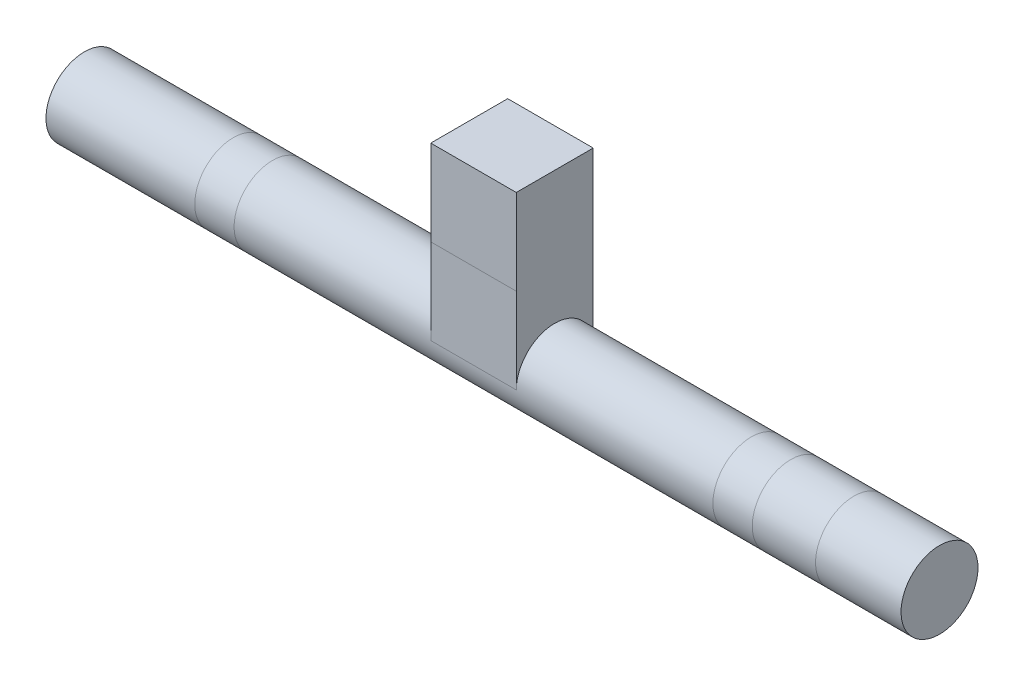
ISO-10303-21;
HEADER;
FILE_DESCRIPTION(('STEP AP214'),'2;1');
FILE_NAME('part.step','',(''),(''),'','','');
FILE_SCHEMA(('AUTOMOTIVE_DESIGN { 1 0 10303 214 1 1 1 1 }'));
ENDSEC;
DATA;
#1=APPLICATION_CONTEXT('core data for automotive mechanical design processes');
#2=APPLICATION_PROTOCOL_DEFINITION('international standard','automotive_design',2000,#1);
#3=PRODUCT_CONTEXT('',#1,'mechanical');
#4=PRODUCT('Part','Part','',(#3));
#5=PRODUCT_RELATED_PRODUCT_CATEGORY('part','',(#4));
#6=PRODUCT_DEFINITION_FORMATION('','',#4);
#7=PRODUCT_DEFINITION_CONTEXT('part definition',#1,'design');
#8=PRODUCT_DEFINITION('design','',#6,#7);
#9=PRODUCT_DEFINITION_SHAPE('','',#8);
#10=(LENGTH_UNIT() NAMED_UNIT(*) SI_UNIT(.MILLI.,.METRE.));
#11=(NAMED_UNIT(*) PLANE_ANGLE_UNIT() SI_UNIT($,.RADIAN.));
#12=(NAMED_UNIT(*) SI_UNIT($,.STERADIAN.) SOLID_ANGLE_UNIT());
#13=UNCERTAINTY_MEASURE_WITH_UNIT(LENGTH_MEASURE(1.E-05),#10,'distance_accuracy_value','');
#14=(GEOMETRIC_REPRESENTATION_CONTEXT(3) GLOBAL_UNCERTAINTY_ASSIGNED_CONTEXT((#13)) GLOBAL_UNIT_ASSIGNED_CONTEXT((#10,
#11,#12)) REPRESENTATION_CONTEXT('',''));
#15=CARTESIAN_POINT('',(0.,0.,0.));
#16=DIRECTION('',(0.,0.,1.));
#17=DIRECTION('',(1.,0.,0.));
#18=AXIS2_PLACEMENT_3D('',#15,#16,#17);
#19=CARTESIAN_POINT('',(50.,200.,45.));
#20=DIRECTION('',(0.,0.,-1.));
#21=DIRECTION('',(0.,1.,0.));
#22=AXIS2_PLACEMENT_3D('',#19,#20,#21);
#23=PLANE('',#22);
#24=DIRECTION('',(1.,0.,0.));
#25=VECTOR('',#24,1.);
#26=CARTESIAN_POINT('',(50.0000000000001,100.,45.));
#27=LINE('',#26,#25);
#28=CARTESIAN_POINT('',(-50.,100.,45.));
#29=VERTEX_POINT('',#28);
#30=CARTESIAN_POINT('',(50.,100.,45.));
#31=VERTEX_POINT('',#30);
#32=EDGE_CURVE('E12',#29,#31,#27,.T.);
#33=ORIENTED_EDGE('',*,*,#32,.F.);
#34=DIRECTION('',(0.,-1.,0.));
#35=VECTOR('',#34,1.);
#36=CARTESIAN_POINT('',(-50.,200.,45.));
#37=LINE('',#36,#35);
#38=CARTESIAN_POINT('',(-50.,0.,45.));
#39=VERTEX_POINT('',#38);
#40=EDGE_CURVE('E154',#29,#39,#37,.T.);
#41=ORIENTED_EDGE('',*,*,#40,.T.);
#42=DIRECTION('',(-1.,0.,0.));
#43=VECTOR('',#42,1.);
#44=CARTESIAN_POINT('',(50.,0.,45.));
#45=LINE('',#44,#43);
#46=CARTESIAN_POINT('',(50.,0.,45.));
#47=VERTEX_POINT('',#46);
#48=EDGE_CURVE('E164',#47,#39,#45,.T.);
#49=ORIENTED_EDGE('',*,*,#48,.F.);
#50=DIRECTION('',(0.,-1.,0.));
#51=VECTOR('',#50,1.);
#52=CARTESIAN_POINT('',(50.,200.,45.));
#53=LINE('',#52,#51);
#54=EDGE_CURVE('E246',#31,#47,#53,.T.);
#55=ORIENTED_EDGE('',*,*,#54,.F.);
#56=EDGE_LOOP('',(#33,#41,#49,#55));
#57=FACE_BOUND('',#56,.T.);
#58=ADVANCED_FACE('F47',(#57),#23,.F.);
#59=CARTESIAN_POINT('',(500.,0.,0.));
#60=DIRECTION('',(-1.,0.,0.));
#61=DIRECTION('',(0.,0.,1.));
#62=AXIS2_PLACEMENT_3D('',#59,#60,#61);
#63=CYLINDRICAL_SURFACE('',#62,45.);
#64=CARTESIAN_POINT('',(280.,0.,0.));
#65=DIRECTION('',(1.,0.,0.));
#66=DIRECTION('',(0.,0.,-1.));
#67=AXIS2_PLACEMENT_3D('',#64,#65,#66);
#68=CIRCLE('',#67,45.);
#69=CARTESIAN_POINT('',(280.,-45.,0.));
#70=VERTEX_POINT('',#69);
#71=CARTESIAN_POINT('',(280.,45.,0.));
#72=VERTEX_POINT('',#71);
#73=EDGE_CURVE('E194',#70,#72,#68,.T.);
#74=ORIENTED_EDGE('',*,*,#73,.T.);
#75=EDGE_CURVE('E198',#72,#70,#68,.T.);
#76=ORIENTED_EDGE('',*,*,#75,.T.);
#77=EDGE_LOOP('',(#74,#76));
#78=FACE_BOUND('',#77,.T.);
#79=CARTESIAN_POINT('',(326.,0.,0.));
#80=DIRECTION('',(1.,0.,0.));
#81=DIRECTION('',(0.,1.,0.));
#82=AXIS2_PLACEMENT_3D('',#79,#80,#81);
#83=CIRCLE('',#82,45.);
#84=CARTESIAN_POINT('',(326.,45.,0.));
#85=VERTEX_POINT('',#84);
#86=CARTESIAN_POINT('',(326.,-45.,0.));
#87=VERTEX_POINT('',#86);
#88=EDGE_CURVE('E56',#85,#87,#83,.T.);
#89=ORIENTED_EDGE('',*,*,#88,.F.);
#90=EDGE_CURVE('E199',#87,#85,#83,.T.);
#91=ORIENTED_EDGE('',*,*,#90,.F.);
#92=EDGE_LOOP('',(#89,#91));
#93=FACE_BOUND('',#92,.T.);
#94=ADVANCED_FACE('F212',(#78,#93),#63,.T.);
#95=DIRECTION('',(-1.,0.,0.));
#96=VECTOR('',#95,1.);
#97=CARTESIAN_POINT('',(50.,0.,-45.));
#98=LINE('',#97,#96);
#99=CARTESIAN_POINT('',(50.,0.,-45.));
#100=VERTEX_POINT('',#99);
#101=CARTESIAN_POINT('',(-50.,0.,-45.));
#102=VERTEX_POINT('',#101);
#103=EDGE_CURVE('E142',#100,#102,#98,.T.);
#104=ORIENTED_EDGE('',*,*,#103,.F.);
#105=CARTESIAN_POINT('',(50.,0.,0.));
#106=DIRECTION('',(1.,0.,0.));
#107=DIRECTION('',(0.,0.,-1.));
#108=AXIS2_PLACEMENT_3D('',#105,#106,#107);
#109=CIRCLE('',#108,45.);
#110=EDGE_CURVE('E130',#100,#47,#109,.T.);
#111=ORIENTED_EDGE('',*,*,#110,.T.);
#112=ORIENTED_EDGE('',*,*,#48,.T.);
#113=CARTESIAN_POINT('',(-50.,0.,0.));
#114=DIRECTION('',(1.,0.,0.));
#115=DIRECTION('',(0.,0.,-1.));
#116=AXIS2_PLACEMENT_3D('',#113,#114,#115);
#117=CIRCLE('',#116,45.);
#118=EDGE_CURVE('E172',#102,#39,#117,.T.);
#119=ORIENTED_EDGE('',*,*,#118,.F.);
#120=EDGE_LOOP('',(#104,#111,#112,#119));
#121=FACE_BOUND('',#120,.T.);
#122=CARTESIAN_POINT('',(-280.,0.,0.));
#123=DIRECTION('',(1.,0.,0.));
#124=DIRECTION('',(0.,0.,-1.));
#125=AXIS2_PLACEMENT_3D('',#122,#123,#124);
#126=CIRCLE('',#125,45.);
#127=CARTESIAN_POINT('',(-280.,-45.,0.));
#128=VERTEX_POINT('',#127);
#129=CARTESIAN_POINT('',(-280.,45.,0.));
#130=VERTEX_POINT('',#129);
#131=EDGE_CURVE('E189',#128,#130,#126,.T.);
#132=ORIENTED_EDGE('',*,*,#131,.T.);
#133=EDGE_CURVE('E193',#130,#128,#126,.T.);
#134=ORIENTED_EDGE('',*,*,#133,.T.);
#135=EDGE_LOOP('',(#132,#134));
#136=FACE_BOUND('',#135,.T.);
#137=ORIENTED_EDGE('',*,*,#75,.F.);
#138=ORIENTED_EDGE('',*,*,#73,.F.);
#139=EDGE_LOOP('',(#137,#138));
#140=FACE_BOUND('',#139,.T.);
#141=ADVANCED_FACE('F215',(#121,#136,#140),#63,.T.);
#142=CARTESIAN_POINT('',(-326.,0.,0.));
#143=DIRECTION('',(1.,0.,0.));
#144=DIRECTION('',(0.,0.,-1.));
#145=AXIS2_PLACEMENT_3D('',#142,#143,#144);
#146=CIRCLE('',#145,45.);
#147=CARTESIAN_POINT('',(-326.,-45.,0.));
#148=VERTEX_POINT('',#147);
#149=CARTESIAN_POINT('',(-326.,45.,0.));
#150=VERTEX_POINT('',#149);
#151=EDGE_CURVE('E178',#148,#150,#146,.T.);
#152=ORIENTED_EDGE('',*,*,#151,.T.);
#153=EDGE_CURVE('E183',#150,#148,#146,.T.);
#154=ORIENTED_EDGE('',*,*,#153,.T.);
#155=EDGE_LOOP('',(#152,#154));
#156=FACE_BOUND('',#155,.T.);
#157=ORIENTED_EDGE('',*,*,#133,.F.);
#158=ORIENTED_EDGE('',*,*,#131,.F.);
#159=EDGE_LOOP('',(#157,#158));
#160=FACE_BOUND('',#159,.T.);
#161=ADVANCED_FACE('F217',(#156,#160),#63,.T.);
#162=ORIENTED_EDGE('',*,*,#90,.T.);
#163=ORIENTED_EDGE('',*,*,#88,.T.);
#164=EDGE_LOOP('',(#162,#163));
#165=FACE_BOUND('',#164,.T.);
#166=CARTESIAN_POINT('',(400.,0.,0.));
#167=DIRECTION('',(1.,0.,0.));
#168=DIRECTION('',(0.,0.,-1.));
#169=AXIS2_PLACEMENT_3D('',#166,#167,#168);
#170=CIRCLE('',#169,45.);
#171=CARTESIAN_POINT('',(400.,45.,0.));
#172=VERTEX_POINT('',#171);
#173=CARTESIAN_POINT('',(400.,-45.,0.));
#174=VERTEX_POINT('',#173);
#175=EDGE_CURVE('E188',#172,#174,#170,.T.);
#176=ORIENTED_EDGE('',*,*,#175,.F.);
#177=EDGE_CURVE('E184',#174,#172,#170,.T.);
#178=ORIENTED_EDGE('',*,*,#177,.F.);
#179=EDGE_LOOP('',(#176,#178));
#180=FACE_BOUND('',#179,.T.);
#181=ADVANCED_FACE('F223',(#165,#180),#63,.T.);
#182=CARTESIAN_POINT('',(-500.,0.,0.));
#183=DIRECTION('',(1.,0.,0.));
#184=DIRECTION('',(0.,0.,-1.));
#185=AXIS2_PLACEMENT_3D('',#182,#183,#184);
#186=CIRCLE('',#185,45.);
#187=CARTESIAN_POINT('',(-500.,0.,-45.));
#188=VERTEX_POINT('',#187);
#189=EDGE_CURVE('E167',#188,#188,#186,.T.);
#190=ORIENTED_EDGE('',*,*,#189,.T.);
#191=EDGE_LOOP('',(#190));
#192=FACE_BOUND('',#191,.T.);
#193=ORIENTED_EDGE('',*,*,#153,.F.);
#194=ORIENTED_EDGE('',*,*,#151,.F.);
#195=EDGE_LOOP('',(#193,#194));
#196=FACE_BOUND('',#195,.T.);
#197=ADVANCED_FACE('F304',(#192,#196),#63,.T.);
#198=ORIENTED_EDGE('',*,*,#177,.T.);
#199=ORIENTED_EDGE('',*,*,#175,.T.);
#200=EDGE_LOOP('',(#198,#199));
#201=FACE_BOUND('',#200,.T.);
#202=CARTESIAN_POINT('',(500.,0.,0.));
#203=DIRECTION('',(1.,0.,0.));
#204=DIRECTION('',(0.,0.,-1.));
#205=AXIS2_PLACEMENT_3D('',#202,#203,#204);
#206=CIRCLE('',#205,45.);
#207=CARTESIAN_POINT('',(500.,0.,-45.));
#208=VERTEX_POINT('',#207);
#209=EDGE_CURVE('E168',#208,#208,#206,.T.);
#210=ORIENTED_EDGE('',*,*,#209,.F.);
#211=EDGE_LOOP('',(#210));
#212=FACE_BOUND('',#211,.T.);
#213=ADVANCED_FACE('F49',(#201,#212),#63,.T.);
#214=CARTESIAN_POINT('',(500.,0.,0.));
#215=DIRECTION('',(1.,0.,0.));
#216=DIRECTION('',(0.,0.,-1.));
#217=AXIS2_PLACEMENT_3D('',#214,#215,#216);
#218=PLANE('',#217);
#219=ORIENTED_EDGE('',*,*,#209,.T.);
#220=EDGE_LOOP('',(#219));
#221=FACE_BOUND('',#220,.T.);
#222=ADVANCED_FACE('F239',(#221),#218,.T.);
#223=CARTESIAN_POINT('',(-500.,0.,0.));
#224=DIRECTION('',(1.,0.,0.));
#225=DIRECTION('',(0.,0.,-1.));
#226=AXIS2_PLACEMENT_3D('',#223,#224,#225);
#227=PLANE('',#226);
#228=ORIENTED_EDGE('',*,*,#189,.F.);
#229=EDGE_LOOP('',(#228));
#230=FACE_BOUND('',#229,.T.);
#231=ADVANCED_FACE('F234',(#230),#227,.F.);
#232=CARTESIAN_POINT('',(-50.,200.,45.));
#233=VERTEX_POINT('',#232);
#234=EDGE_CURVE('E151',#233,#29,#37,.T.);
#235=ORIENTED_EDGE('',*,*,#234,.T.);
#236=ORIENTED_EDGE('',*,*,#32,.T.);
#237=CARTESIAN_POINT('',(50.,200.,45.));
#238=VERTEX_POINT('',#237);
#239=EDGE_CURVE('E133',#238,#31,#53,.T.);
#240=ORIENTED_EDGE('',*,*,#239,.F.);
#241=DIRECTION('',(-1.,0.,0.));
#242=VECTOR('',#241,1.);
#243=CARTESIAN_POINT('',(50.,200.,45.));
#244=LINE('',#243,#242);
#245=EDGE_CURVE('E143',#238,#233,#244,.T.);
#246=ORIENTED_EDGE('',*,*,#245,.T.);
#247=EDGE_LOOP('',(#235,#236,#240,#246));
#248=FACE_BOUND('',#247,.T.);
#249=ADVANCED_FACE('F228',(#248),#23,.F.);
#250=CARTESIAN_POINT('',(50.,200.,-45.));
#251=DIRECTION('',(0.,0.,1.));
#252=DIRECTION('',(0.,-1.,0.));
#253=AXIS2_PLACEMENT_3D('',#250,#251,#252);
#254=PLANE('',#253);
#255=DIRECTION('',(0.,1.,0.));
#256=VECTOR('',#255,1.);
#257=CARTESIAN_POINT('',(-50.,200.,-45.));
#258=LINE('',#257,#256);
#259=CARTESIAN_POINT('',(-50.,200.,-45.));
#260=VERTEX_POINT('',#259);
#261=EDGE_CURVE('E139',#102,#260,#258,.T.);
#262=ORIENTED_EDGE('',*,*,#261,.T.);
#263=DIRECTION('',(-1.,0.,0.));
#264=VECTOR('',#263,1.);
#265=CARTESIAN_POINT('',(50.,200.,-45.));
#266=LINE('',#265,#264);
#267=CARTESIAN_POINT('',(50.,200.,-45.));
#268=VERTEX_POINT('',#267);
#269=EDGE_CURVE('E136',#268,#260,#266,.T.);
#270=ORIENTED_EDGE('',*,*,#269,.F.);
#271=DIRECTION('',(0.,1.,0.));
#272=VECTOR('',#271,1.);
#273=CARTESIAN_POINT('',(50.,200.,-45.));
#274=LINE('',#273,#272);
#275=EDGE_CURVE('E122',#100,#268,#274,.T.);
#276=ORIENTED_EDGE('',*,*,#275,.F.);
#277=ORIENTED_EDGE('',*,*,#103,.T.);
#278=EDGE_LOOP('',(#262,#270,#276,#277));
#279=FACE_BOUND('',#278,.T.);
#280=ADVANCED_FACE('F137',(#279),#254,.F.);
#281=CARTESIAN_POINT('',(50.,200.,45.));
#282=DIRECTION('',(0.,-1.,0.));
#283=DIRECTION('',(0.,0.,-1.));
#284=AXIS2_PLACEMENT_3D('',#281,#282,#283);
#285=PLANE('',#284);
#286=DIRECTION('',(0.,0.,1.));
#287=VECTOR('',#286,1.);
#288=CARTESIAN_POINT('',(-50.,200.,45.));
#289=LINE('',#288,#287);
#290=EDGE_CURVE('E161',#260,#233,#289,.T.);
#291=ORIENTED_EDGE('',*,*,#290,.T.);
#292=ORIENTED_EDGE('',*,*,#245,.F.);
#293=DIRECTION('',(0.,0.,1.));
#294=VECTOR('',#293,1.);
#295=CARTESIAN_POINT('',(50.,200.,45.));
#296=LINE('',#295,#294);
#297=EDGE_CURVE('E127',#268,#238,#296,.T.);
#298=ORIENTED_EDGE('',*,*,#297,.F.);
#299=ORIENTED_EDGE('',*,*,#269,.T.);
#300=EDGE_LOOP('',(#291,#292,#298,#299));
#301=FACE_BOUND('',#300,.T.);
#302=ADVANCED_FACE('F145',(#301),#285,.F.);
#303=CARTESIAN_POINT('',(50.,0.,0.));
#304=DIRECTION('',(1.,0.,0.));
#305=DIRECTION('',(0.,0.,-1.));
#306=AXIS2_PLACEMENT_3D('',#303,#304,#305);
#307=PLANE('',#306);
#308=ORIENTED_EDGE('',*,*,#110,.F.);
#309=ORIENTED_EDGE('',*,*,#275,.T.);
#310=ORIENTED_EDGE('',*,*,#297,.T.);
#311=ORIENTED_EDGE('',*,*,#239,.T.);
#312=ORIENTED_EDGE('',*,*,#54,.T.);
#313=EDGE_LOOP('',(#308,#309,#310,#311,#312));
#314=FACE_BOUND('',#313,.T.);
#315=ADVANCED_FACE('F124',(#314),#307,.T.);
#316=CARTESIAN_POINT('',(-50.,0.,0.));
#317=DIRECTION('',(1.,0.,0.));
#318=DIRECTION('',(0.,0.,-1.));
#319=AXIS2_PLACEMENT_3D('',#316,#317,#318);
#320=PLANE('',#319);
#321=ORIENTED_EDGE('',*,*,#261,.F.);
#322=ORIENTED_EDGE('',*,*,#118,.T.);
#323=ORIENTED_EDGE('',*,*,#40,.F.);
#324=ORIENTED_EDGE('',*,*,#234,.F.);
#325=ORIENTED_EDGE('',*,*,#290,.F.);
#326=EDGE_LOOP('',(#321,#322,#323,#324,#325));
#327=FACE_BOUND('',#326,.T.);
#328=ADVANCED_FACE('F243',(#327),#320,.F.);
#329=CLOSED_SHELL('',(#58,#94,#141,#161,#181,#197,#213,#222,#231,#249,#280,#302,#315,#328));
#330=MANIFOLD_SOLID_BREP('B2',#329);
#331=ADVANCED_BREP_SHAPE_REPRESENTATION('',(#18,#330),#14);
#332=SHAPE_DEFINITION_REPRESENTATION(#9,#331);
ENDSEC;
END-ISO-10303-21;
